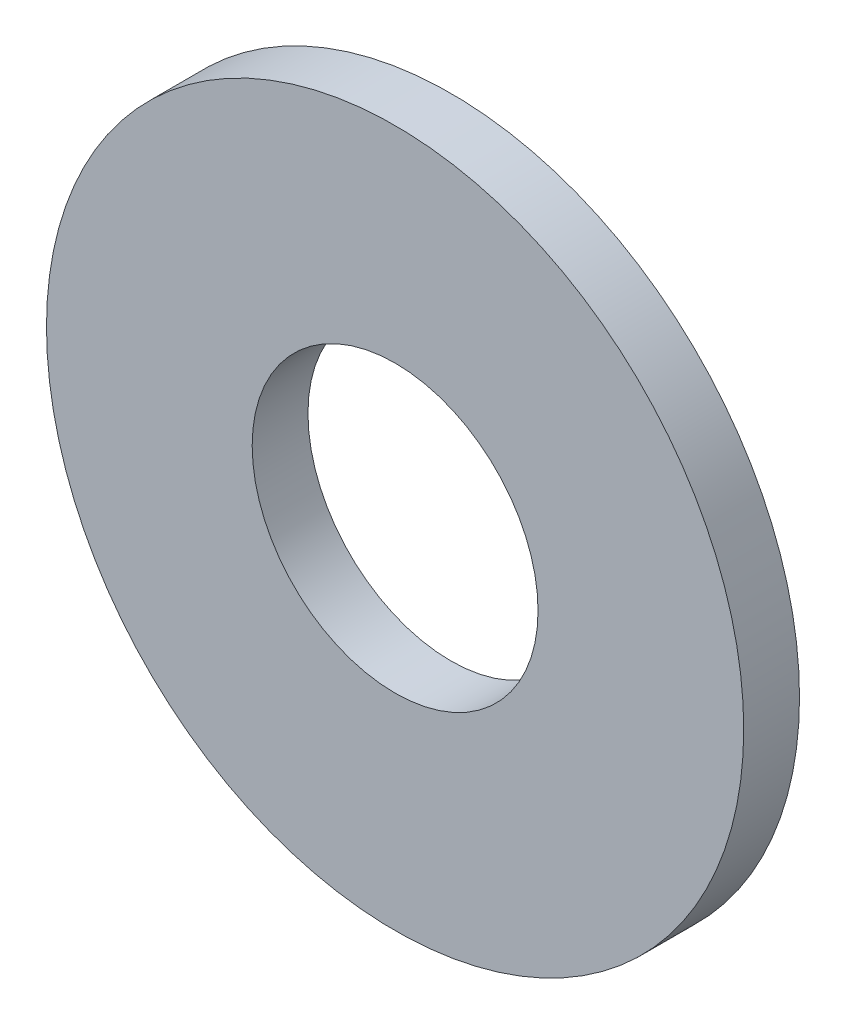
ISO-10303-21;
HEADER;
FILE_DESCRIPTION(('STEP AP214'),'2;1');
FILE_NAME('part.step','',(''),(''),'','','');
FILE_SCHEMA(('AUTOMOTIVE_DESIGN { 1 0 10303 214 1 1 1 1 }'));
ENDSEC;
DATA;
#1=APPLICATION_CONTEXT('core data for automotive mechanical design processes');
#2=APPLICATION_PROTOCOL_DEFINITION('international standard','automotive_design',2000,#1);
#3=PRODUCT_CONTEXT('',#1,'mechanical');
#4=PRODUCT('Part','Part','',(#3));
#5=PRODUCT_RELATED_PRODUCT_CATEGORY('part','',(#4));
#6=PRODUCT_DEFINITION_FORMATION('','',#4);
#7=PRODUCT_DEFINITION_CONTEXT('part definition',#1,'design');
#8=PRODUCT_DEFINITION('design','',#6,#7);
#9=PRODUCT_DEFINITION_SHAPE('','',#8);
#10=(LENGTH_UNIT() NAMED_UNIT(*) SI_UNIT(.MILLI.,.METRE.));
#11=(NAMED_UNIT(*) PLANE_ANGLE_UNIT() SI_UNIT($,.RADIAN.));
#12=(NAMED_UNIT(*) SI_UNIT($,.STERADIAN.) SOLID_ANGLE_UNIT());
#13=UNCERTAINTY_MEASURE_WITH_UNIT(LENGTH_MEASURE(1.E-05),#10,'distance_accuracy_value','');
#14=(GEOMETRIC_REPRESENTATION_CONTEXT(3) GLOBAL_UNCERTAINTY_ASSIGNED_CONTEXT((#13)) GLOBAL_UNIT_ASSIGNED_CONTEXT((#10,
#11,#12)) REPRESENTATION_CONTEXT('',''));
#15=CARTESIAN_POINT('',(0.,0.,0.));
#16=DIRECTION('',(0.,0.,1.));
#17=DIRECTION('',(1.,0.,0.));
#18=AXIS2_PLACEMENT_3D('',#15,#16,#17);
#19=CARTESIAN_POINT('',(0.,0.,0.8));
#20=DIRECTION('',(0.,0.,1.));
#21=DIRECTION('',(1.,0.,0.));
#22=AXIS2_PLACEMENT_3D('',#19,#20,#21);
#23=PLANE('',#22);
#24=CARTESIAN_POINT('',(0.,0.,0.8));
#25=DIRECTION('',(0.,0.,1.));
#26=DIRECTION('',(1.,0.,0.));
#27=AXIS2_PLACEMENT_3D('',#24,#25,#26);
#28=CIRCLE('',#27,5.);
#29=CARTESIAN_POINT('',(5.,0.,0.8));
#30=VERTEX_POINT('',#29);
#31=EDGE_CURVE('E10',#30,#30,#28,.T.);
#32=ORIENTED_EDGE('',*,*,#31,.T.);
#33=EDGE_LOOP('',(#32));
#34=FACE_BOUND('',#33,.T.);
#35=CARTESIAN_POINT('',(0.,0.,0.8));
#36=DIRECTION('',(0.,0.,1.));
#37=DIRECTION('',(1.,0.,0.));
#38=AXIS2_PLACEMENT_3D('',#35,#36,#37);
#39=CIRCLE('',#38,2.05);
#40=CARTESIAN_POINT('',(2.05,0.,0.8));
#41=VERTEX_POINT('',#40);
#42=EDGE_CURVE('E44',#41,#41,#39,.T.);
#43=ORIENTED_EDGE('',*,*,#42,.F.);
#44=EDGE_LOOP('',(#43));
#45=FACE_BOUND('',#44,.T.);
#46=ADVANCED_FACE('F33',(#34,#45),#23,.T.);
#47=CARTESIAN_POINT('',(0.,0.,0.));
#48=DIRECTION('',(0.,0.,1.));
#49=DIRECTION('',(1.,0.,0.));
#50=AXIS2_PLACEMENT_3D('',#47,#48,#49);
#51=PLANE('',#50);
#52=CARTESIAN_POINT('',(0.,0.,0.));
#53=DIRECTION('',(0.,0.,1.));
#54=DIRECTION('',(1.,0.,0.));
#55=AXIS2_PLACEMENT_3D('',#52,#53,#54);
#56=CIRCLE('',#55,5.);
#57=CARTESIAN_POINT('',(5.,0.,0.));
#58=VERTEX_POINT('',#57);
#59=EDGE_CURVE('E37',#58,#58,#56,.T.);
#60=ORIENTED_EDGE('',*,*,#59,.F.);
#61=EDGE_LOOP('',(#60));
#62=FACE_BOUND('',#61,.T.);
#63=CARTESIAN_POINT('',(0.,0.,0.));
#64=DIRECTION('',(0.,0.,1.));
#65=DIRECTION('',(1.,0.,0.));
#66=AXIS2_PLACEMENT_3D('',#63,#64,#65);
#67=CIRCLE('',#66,2.05);
#68=CARTESIAN_POINT('',(2.05,0.,0.));
#69=VERTEX_POINT('',#68);
#70=EDGE_CURVE('E46',#69,#69,#67,.T.);
#71=ORIENTED_EDGE('',*,*,#70,.T.);
#72=EDGE_LOOP('',(#71));
#73=FACE_BOUND('',#72,.T.);
#74=ADVANCED_FACE('F56',(#62,#73),#51,.F.);
#75=CARTESIAN_POINT('',(0.,0.,0.8));
#76=DIRECTION('',(0.,0.,-1.));
#77=DIRECTION('',(-1.,0.,0.));
#78=AXIS2_PLACEMENT_3D('',#75,#76,#77);
#79=CYLINDRICAL_SURFACE('',#78,5.);
#80=ORIENTED_EDGE('',*,*,#31,.F.);
#81=EDGE_LOOP('',(#80));
#82=FACE_BOUND('',#81,.T.);
#83=ORIENTED_EDGE('',*,*,#59,.T.);
#84=EDGE_LOOP('',(#83));
#85=FACE_BOUND('',#84,.T.);
#86=ADVANCED_FACE('F35',(#82,#85),#79,.T.);
#87=CARTESIAN_POINT('',(0.,0.,0.8));
#88=DIRECTION('',(0.,0.,-1.));
#89=DIRECTION('',(-1.,0.,0.));
#90=AXIS2_PLACEMENT_3D('',#87,#88,#89);
#91=CYLINDRICAL_SURFACE('',#90,2.05);
#92=ORIENTED_EDGE('',*,*,#42,.T.);
#93=EDGE_LOOP('',(#92));
#94=FACE_BOUND('',#93,.T.);
#95=ORIENTED_EDGE('',*,*,#70,.F.);
#96=EDGE_LOOP('',(#95));
#97=FACE_BOUND('',#96,.T.);
#98=ADVANCED_FACE('F52',(#94,#97),#91,.F.);
#99=CLOSED_SHELL('',(#46,#74,#86,#98));
#100=MANIFOLD_SOLID_BREP('B2',#99);
#101=ADVANCED_BREP_SHAPE_REPRESENTATION('',(#18,#100),#14);
#102=SHAPE_DEFINITION_REPRESENTATION(#9,#101);
ENDSEC;
END-ISO-10303-21;
